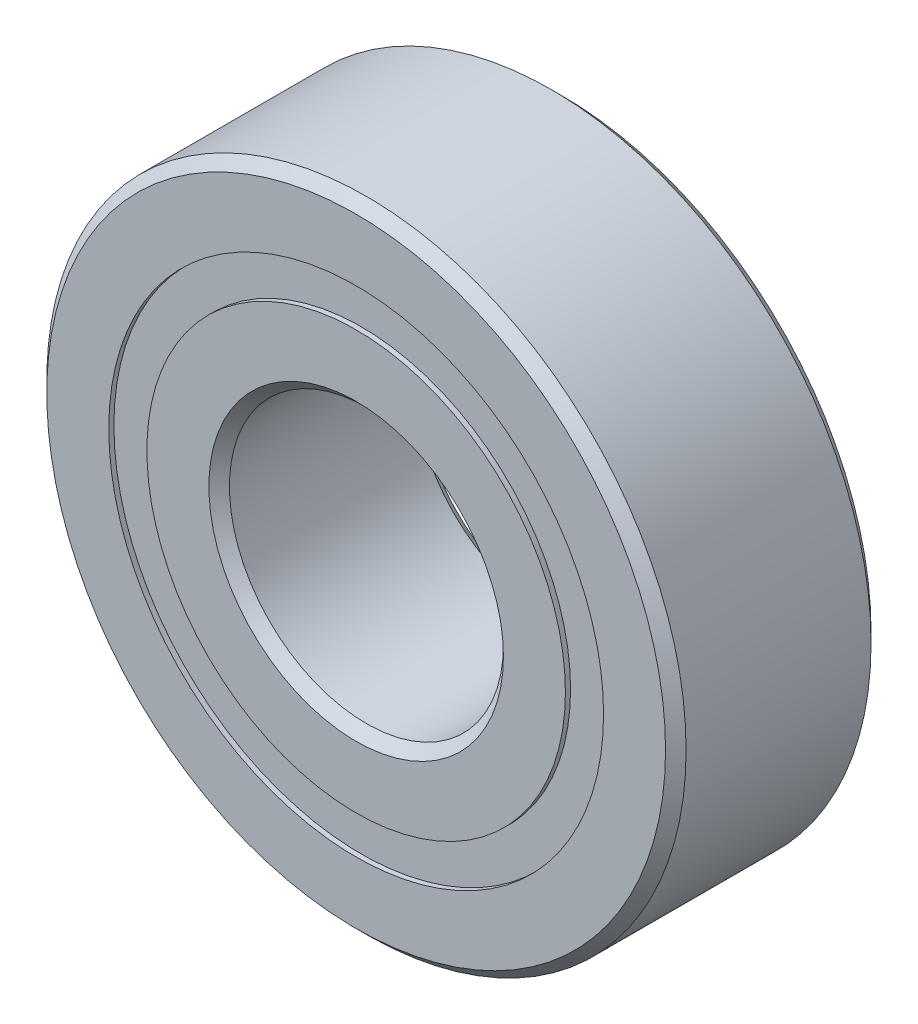
ISO-10303-21;
HEADER;
FILE_DESCRIPTION(('STEP AP214'),'2;1');
FILE_NAME('part.step','',(''),(''),'','','');
FILE_SCHEMA(('AUTOMOTIVE_DESIGN { 1 0 10303 214 1 1 1 1 }'));
ENDSEC;
DATA;
#1=APPLICATION_CONTEXT('core data for automotive mechanical design processes');
#2=APPLICATION_PROTOCOL_DEFINITION('international standard','automotive_design',2000,#1);
#3=PRODUCT_CONTEXT('',#1,'mechanical');
#4=PRODUCT('Part','Part','',(#3));
#5=PRODUCT_RELATED_PRODUCT_CATEGORY('part','',(#4));
#6=PRODUCT_DEFINITION_FORMATION('','',#4);
#7=PRODUCT_DEFINITION_CONTEXT('part definition',#1,'design');
#8=PRODUCT_DEFINITION('design','',#6,#7);
#9=PRODUCT_DEFINITION_SHAPE('','',#8);
#10=(LENGTH_UNIT() NAMED_UNIT(*) SI_UNIT(.MILLI.,.METRE.));
#11=(NAMED_UNIT(*) PLANE_ANGLE_UNIT() SI_UNIT($,.RADIAN.));
#12=(NAMED_UNIT(*) SI_UNIT($,.STERADIAN.) SOLID_ANGLE_UNIT());
#13=UNCERTAINTY_MEASURE_WITH_UNIT(LENGTH_MEASURE(1.E-05),#10,'distance_accuracy_value','');
#14=(GEOMETRIC_REPRESENTATION_CONTEXT(3) GLOBAL_UNCERTAINTY_ASSIGNED_CONTEXT((#13)) GLOBAL_UNIT_ASSIGNED_CONTEXT((#10,
#11,#12)) REPRESENTATION_CONTEXT('',''));
#15=CARTESIAN_POINT('',(0.,0.,0.));
#16=DIRECTION('',(0.,0.,1.));
#17=DIRECTION('',(1.,0.,0.));
#18=AXIS2_PLACEMENT_3D('',#15,#16,#17);
#19=CARTESIAN_POINT('',(0.,8.60041208791209,-3.39328125));
#20=DIRECTION('',(0.,0.,1.));
#21=DIRECTION('',(1.,0.,0.));
#22=AXIS2_PLACEMENT_3D('',#19,#20,#21);
#23=PLANE('',#22);
#24=CARTESIAN_POINT('',(0.,0.,-3.39328125));
#25=DIRECTION('',(0.,0.,1.));
#26=DIRECTION('',(1.,0.,0.));
#27=AXIS2_PLACEMENT_3D('',#24,#25,#26);
#28=CIRCLE('',#27,8.60041208791209);
#29=CARTESIAN_POINT('',(8.60041208791209,0.,-3.39328125));
#30=VERTEX_POINT('',#29);
#31=EDGE_CURVE('E57',#30,#30,#28,.T.);
#32=ORIENTED_EDGE('',*,*,#31,.F.);
#33=EDGE_LOOP('',(#32));
#34=FACE_BOUND('',#33,.T.);
#35=CARTESIAN_POINT('',(0.,0.,-3.39328125));
#36=DIRECTION('',(0.,0.,1.));
#37=DIRECTION('',(1.,0.,0.));
#38=AXIS2_PLACEMENT_3D('',#35,#36,#37);
#39=CIRCLE('',#38,7.27458791208791);
#40=CARTESIAN_POINT('',(7.27458791208791,0.,-3.39328125));
#41=VERTEX_POINT('',#40);
#42=EDGE_CURVE('E11',#41,#41,#39,.T.);
#43=ORIENTED_EDGE('',*,*,#42,.T.);
#44=EDGE_LOOP('',(#43));
#45=FACE_BOUND('',#44,.T.);
#46=ADVANCED_FACE('F43',(#34,#45),#23,.F.);
#47=CARTESIAN_POINT('',(0.,0.,3.571875));
#48=DIRECTION('',(0.,0.,1.));
#49=DIRECTION('',(1.,0.,0.));
#50=AXIS2_PLACEMENT_3D('',#47,#48,#49);
#51=CYLINDRICAL_SURFACE('',#50,7.27458791208791);
#52=ORIENTED_EDGE('',*,*,#42,.F.);
#53=EDGE_LOOP('',(#52));
#54=FACE_BOUND('',#53,.T.);
#55=CARTESIAN_POINT('',(0.,0.,-1.72035132641561));
#56=DIRECTION('',(0.,0.,1.));
#57=DIRECTION('',(1.,0.,0.));
#58=AXIS2_PLACEMENT_3D('',#55,#56,#57);
#59=CIRCLE('',#58,7.27458791208791);
#60=CARTESIAN_POINT('',(7.27458791208791,0.,-1.72035132641561));
#61=VERTEX_POINT('',#60);
#62=EDGE_CURVE('E49',#61,#61,#59,.T.);
#63=ORIENTED_EDGE('',*,*,#62,.T.);
#64=EDGE_LOOP('',(#63));
#65=FACE_BOUND('',#64,.T.);
#66=ADVANCED_FACE('F66',(#54,#65),#51,.F.);
#67=CARTESIAN_POINT('',(0.,8.60041208791209,-1.72035132641561));
#68=DIRECTION('',(0.,0.,-1.));
#69=DIRECTION('',(-1.,0.,0.));
#70=AXIS2_PLACEMENT_3D('',#67,#68,#69);
#71=PLANE('',#70);
#72=ORIENTED_EDGE('',*,*,#62,.F.);
#73=EDGE_LOOP('',(#72));
#74=FACE_BOUND('',#73,.T.);
#75=CARTESIAN_POINT('',(0.,0.,-1.72035132641561));
#76=DIRECTION('',(0.,0.,1.));
#77=DIRECTION('',(1.,0.,0.));
#78=AXIS2_PLACEMENT_3D('',#75,#76,#77);
#79=CIRCLE('',#78,8.60041208791209);
#80=CARTESIAN_POINT('',(8.60041208791209,0.,-1.72035132641561));
#81=VERTEX_POINT('',#80);
#82=EDGE_CURVE('E53',#81,#81,#79,.T.);
#83=ORIENTED_EDGE('',*,*,#82,.T.);
#84=EDGE_LOOP('',(#83));
#85=FACE_BOUND('',#84,.T.);
#86=ADVANCED_FACE('F70',(#74,#85),#71,.F.);
#87=CARTESIAN_POINT('',(0.,0.,3.571875));
#88=DIRECTION('',(0.,0.,1.));
#89=DIRECTION('',(1.,0.,0.));
#90=AXIS2_PLACEMENT_3D('',#87,#88,#89);
#91=CYLINDRICAL_SURFACE('',#90,8.60041208791209);
#92=ORIENTED_EDGE('',*,*,#82,.F.);
#93=EDGE_LOOP('',(#92));
#94=FACE_BOUND('',#93,.T.);
#95=ORIENTED_EDGE('',*,*,#31,.T.);
#96=EDGE_LOOP('',(#95));
#97=FACE_BOUND('',#96,.T.);
#98=ADVANCED_FACE('F63',(#94,#97),#91,.T.);
#99=CLOSED_SHELL('',(#46,#66,#86,#98));
#100=MANIFOLD_SOLID_BREP('B2',#99);
#101=CARTESIAN_POINT('',(0.,8.60041208791209,3.39328125));
#102=DIRECTION('',(0.,0.,-1.));
#103=DIRECTION('',(-1.,0.,0.));
#104=AXIS2_PLACEMENT_3D('',#101,#102,#103);
#105=PLANE('',#104);
#106=CARTESIAN_POINT('',(0.,0.,3.39328125));
#107=DIRECTION('',(0.,0.,1.));
#108=DIRECTION('',(1.,0.,0.));
#109=AXIS2_PLACEMENT_3D('',#106,#107,#108);
#110=CIRCLE('',#109,7.27458791208791);
#111=CARTESIAN_POINT('',(7.27458791208791,0.,3.39328125));
#112=VERTEX_POINT('',#111);
#113=EDGE_CURVE('E42',#112,#112,#110,.T.);
#114=ORIENTED_EDGE('',*,*,#113,.F.);
#115=EDGE_LOOP('',(#114));
#116=FACE_BOUND('',#115,.T.);
#117=CARTESIAN_POINT('',(0.,0.,3.39328125));
#118=DIRECTION('',(0.,0.,1.));
#119=DIRECTION('',(1.,0.,0.));
#120=AXIS2_PLACEMENT_3D('',#117,#118,#119);
#121=CIRCLE('',#120,8.60041208791209);
#122=CARTESIAN_POINT('',(8.60041208791209,0.,3.39328125));
#123=VERTEX_POINT('',#122);
#124=EDGE_CURVE('E124',#123,#123,#121,.T.);
#125=ORIENTED_EDGE('',*,*,#124,.T.);
#126=EDGE_LOOP('',(#125));
#127=FACE_BOUND('',#126,.T.);
#128=ADVANCED_FACE('F110',(#116,#127),#105,.F.);
#129=CARTESIAN_POINT('',(0.,0.,3.571875));
#130=DIRECTION('',(0.,0.,1.));
#131=DIRECTION('',(1.,0.,0.));
#132=AXIS2_PLACEMENT_3D('',#129,#130,#131);
#133=CYLINDRICAL_SURFACE('',#132,7.27458791208791);
#134=CARTESIAN_POINT('',(0.,0.,1.72035132641561));
#135=DIRECTION('',(0.,0.,1.));
#136=DIRECTION('',(1.,0.,0.));
#137=AXIS2_PLACEMENT_3D('',#134,#135,#136);
#138=CIRCLE('',#137,7.27458791208791);
#139=CARTESIAN_POINT('',(7.27458791208791,0.,1.72035132641561));
#140=VERTEX_POINT('',#139);
#141=EDGE_CURVE('E116',#140,#140,#138,.T.);
#142=ORIENTED_EDGE('',*,*,#141,.F.);
#143=EDGE_LOOP('',(#142));
#144=FACE_BOUND('',#143,.T.);
#145=ORIENTED_EDGE('',*,*,#113,.T.);
#146=EDGE_LOOP('',(#145));
#147=FACE_BOUND('',#146,.T.);
#148=ADVANCED_FACE('F139',(#144,#147),#133,.F.);
#149=CARTESIAN_POINT('',(0.,8.60041208791209,1.72035132641561));
#150=DIRECTION('',(0.,0.,1.));
#151=DIRECTION('',(1.,0.,0.));
#152=AXIS2_PLACEMENT_3D('',#149,#150,#151);
#153=PLANE('',#152);
#154=CARTESIAN_POINT('',(0.,0.,1.72035132641561));
#155=DIRECTION('',(0.,0.,1.));
#156=DIRECTION('',(1.,0.,0.));
#157=AXIS2_PLACEMENT_3D('',#154,#155,#156);
#158=CIRCLE('',#157,8.60041208791209);
#159=CARTESIAN_POINT('',(8.60041208791209,0.,1.72035132641561));
#160=VERTEX_POINT('',#159);
#161=EDGE_CURVE('E120',#160,#160,#158,.T.);
#162=ORIENTED_EDGE('',*,*,#161,.F.);
#163=EDGE_LOOP('',(#162));
#164=FACE_BOUND('',#163,.T.);
#165=ORIENTED_EDGE('',*,*,#141,.T.);
#166=EDGE_LOOP('',(#165));
#167=FACE_BOUND('',#166,.T.);
#168=ADVANCED_FACE('F134',(#164,#167),#153,.F.);
#169=CARTESIAN_POINT('',(0.,0.,3.571875));
#170=DIRECTION('',(0.,0.,1.));
#171=DIRECTION('',(1.,0.,0.));
#172=AXIS2_PLACEMENT_3D('',#169,#170,#171);
#173=CYLINDRICAL_SURFACE('',#172,8.60041208791209);
#174=ORIENTED_EDGE('',*,*,#124,.F.);
#175=EDGE_LOOP('',(#174));
#176=FACE_BOUND('',#175,.T.);
#177=ORIENTED_EDGE('',*,*,#161,.T.);
#178=EDGE_LOOP('',(#177));
#179=FACE_BOUND('',#178,.T.);
#180=ADVANCED_FACE('F131',(#176,#179),#173,.T.);
#181=CLOSED_SHELL('',(#128,#148,#168,#180));
#182=MANIFOLD_SOLID_BREP('B6',#181);
#183=CARTESIAN_POINT('',(-4.66554544007142,6.42157239285121,0.));
#184=DIRECTION('',(0.,0.,1.));
#185=DIRECTION('',(-0.587785252292462,0.809016994374955,0.));
#186=AXIS2_PLACEMENT_3D('',#183,#184,#185);
#187=SPHERICAL_SURFACE('',#186,1.72035132641561);
#188=CARTESIAN_POINT('',(-4.66554544007142,6.42157239285121,1.72035132641561));
#189=VERTEX_POINT('',#188);
#190=VERTEX_LOOP('',#189);
#191=FACE_BOUND('',#190,.T.);
#192=ADVANCED_FACE('F177',(#191),#187,.T.);
#193=CLOSED_SHELL('',(#192));
#194=MANIFOLD_SOLID_BREP('B37',#193);
#195=CARTESIAN_POINT('',(-7.54901109809275,2.45282239285123,0.));
#196=DIRECTION('',(0.,0.,1.));
#197=DIRECTION('',(-0.95105651629515,0.309016994374958,0.));
#198=AXIS2_PLACEMENT_3D('',#195,#196,#197);
#199=SPHERICAL_SURFACE('',#198,1.72035132641561);
#200=CARTESIAN_POINT('',(-7.54901109809275,2.45282239285123,1.72035132641561));
#201=VERTEX_POINT('',#200);
#202=VERTEX_LOOP('',#201);
#203=FACE_BOUND('',#202,.T.);
#204=ADVANCED_FACE('F197',(#203),#199,.T.);
#205=CLOSED_SHELL('',(#204));
#206=MANIFOLD_SOLID_BREP('B106',#205);
#207=CARTESIAN_POINT('',(-7.54901109809281,-2.45282239285107,0.));
#208=DIRECTION('',(0.,0.,1.));
#209=DIRECTION('',(-0.951056516295157,-0.309016994374938,0.));
#210=AXIS2_PLACEMENT_3D('',#207,#208,#209);
#211=SPHERICAL_SURFACE('',#210,1.72035132641561);
#212=CARTESIAN_POINT('',(-7.54901109809281,-2.45282239285107,1.72035132641561));
#213=VERTEX_POINT('',#212);
#214=VERTEX_LOOP('',#213);
#215=FACE_BOUND('',#214,.T.);
#216=ADVANCED_FACE('F217',(#215),#211,.T.);
#217=CLOSED_SHELL('',(#216));
#218=MANIFOLD_SOLID_BREP('B173',#217);
#219=CARTESIAN_POINT('',(-4.66554544007156,-6.42157239285111,0.));
#220=DIRECTION('',(0.,0.,1.));
#221=DIRECTION('',(-0.58778525229248,-0.809016994374942,0.));
#222=AXIS2_PLACEMENT_3D('',#219,#220,#221);
#223=SPHERICAL_SURFACE('',#222,1.72035132641561);
#224=CARTESIAN_POINT('',(-4.66554544007156,-6.42157239285111,1.72035132641561));
#225=VERTEX_POINT('',#224);
#226=VERTEX_LOOP('',#225);
#227=FACE_BOUND('',#226,.T.);
#228=ADVANCED_FACE('F237',(#227),#223,.T.);
#229=CLOSED_SHELL('',(#228));
#230=MANIFOLD_SOLID_BREP('B193',#229);
#231=CARTESIAN_POINT('',(0.,-7.9375,0.));
#232=DIRECTION('',(0.,0.,1.));
#233=DIRECTION('',(0.,-1.,0.));
#234=AXIS2_PLACEMENT_3D('',#231,#232,#233);
#235=SPHERICAL_SURFACE('',#234,1.72035132641561);
#236=CARTESIAN_POINT('',(0.,-7.9375,1.72035132641561));
#237=VERTEX_POINT('',#236);
#238=VERTEX_LOOP('',#237);
#239=FACE_BOUND('',#238,.T.);
#240=ADVANCED_FACE('F257',(#239),#235,.T.);
#241=CLOSED_SHELL('',(#240));
#242=MANIFOLD_SOLID_BREP('B213',#241);
#243=CARTESIAN_POINT('',(4.66554544007147,-6.42157239285117,0.));
#244=DIRECTION('',(0.,0.,1.));
#245=DIRECTION('',(0.587785252292469,-0.809016994374951,0.));
#246=AXIS2_PLACEMENT_3D('',#243,#244,#245);
#247=SPHERICAL_SURFACE('',#246,1.72035132641561);
#248=CARTESIAN_POINT('',(4.66554544007147,-6.42157239285117,1.72035132641561));
#249=VERTEX_POINT('',#248);
#250=VERTEX_LOOP('',#249);
#251=FACE_BOUND('',#250,.T.);
#252=ADVANCED_FACE('F277',(#251),#247,.T.);
#253=CLOSED_SHELL('',(#252));
#254=MANIFOLD_SOLID_BREP('B233',#253);
#255=CARTESIAN_POINT('',(7.54901109809277,-2.45282239285118,0.));
#256=DIRECTION('',(0.,0.,1.));
#257=DIRECTION('',(0.951056516295152,-0.309016994374952,0.));
#258=AXIS2_PLACEMENT_3D('',#255,#256,#257);
#259=SPHERICAL_SURFACE('',#258,1.72035132641561);
#260=CARTESIAN_POINT('',(7.54901109809277,-2.45282239285118,1.72035132641561));
#261=VERTEX_POINT('',#260);
#262=VERTEX_LOOP('',#261);
#263=FACE_BOUND('',#262,.T.);
#264=ADVANCED_FACE('F297',(#263),#259,.T.);
#265=CLOSED_SHELL('',(#264));
#266=MANIFOLD_SOLID_BREP('B253',#265);
#267=CARTESIAN_POINT('',(7.54901109809279,2.45282239285112,0.));
#268=DIRECTION('',(0.,0.,1.));
#269=DIRECTION('',(0.951056516295155,0.309016994374945,0.));
#270=AXIS2_PLACEMENT_3D('',#267,#268,#269);
#271=SPHERICAL_SURFACE('',#270,1.72035132641561);
#272=CARTESIAN_POINT('',(7.54901109809279,2.45282239285112,1.72035132641561));
#273=VERTEX_POINT('',#272);
#274=VERTEX_LOOP('',#273);
#275=FACE_BOUND('',#274,.T.);
#276=ADVANCED_FACE('F317',(#275),#271,.T.);
#277=CLOSED_SHELL('',(#276));
#278=MANIFOLD_SOLID_BREP('B273',#277);
#279=CARTESIAN_POINT('',(4.66554544007152,6.42157239285114,0.));
#280=DIRECTION('',(0.,0.,1.));
#281=DIRECTION('',(0.587785252292474,0.809016994374947,0.));
#282=AXIS2_PLACEMENT_3D('',#279,#280,#281);
#283=SPHERICAL_SURFACE('',#282,1.72035132641561);
#284=CARTESIAN_POINT('',(4.66554544007152,6.42157239285114,1.72035132641561));
#285=VERTEX_POINT('',#284);
#286=VERTEX_LOOP('',#285);
#287=FACE_BOUND('',#286,.T.);
#288=ADVANCED_FACE('F337',(#287),#283,.T.);
#289=CLOSED_SHELL('',(#288));
#290=MANIFOLD_SOLID_BREP('B293',#289);
#291=CARTESIAN_POINT('',(0.,7.9375,0.));
#292=DIRECTION('',(0.,0.,1.));
#293=DIRECTION('',(0.,1.,0.));
#294=AXIS2_PLACEMENT_3D('',#291,#292,#293);
#295=SPHERICAL_SURFACE('',#294,1.72035132641561);
#296=CARTESIAN_POINT('',(0.,7.9375,1.72035132641561));
#297=VERTEX_POINT('',#296);
#298=VERTEX_LOOP('',#297);
#299=FACE_BOUND('',#298,.T.);
#300=ADVANCED_FACE('F359',(#299),#295,.T.);
#301=CLOSED_SHELL('',(#300));
#302=MANIFOLD_SOLID_BREP('B313',#301);
#303=CARTESIAN_POINT('',(0.,7.27458791208791,3.571875));
#304=DIRECTION('',(0.,0.,-1.));
#305=DIRECTION('',(-1.,0.,0.));
#306=AXIS2_PLACEMENT_3D('',#303,#304,#305);
#307=PLANE('',#306);
#308=CARTESIAN_POINT('',(0.,0.,3.571875));
#309=DIRECTION('',(0.,0.,1.));
#310=DIRECTION('',(1.,0.,0.));
#311=AXIS2_PLACEMENT_3D('',#308,#309,#310);
#312=CIRCLE('',#311,5.1196875);
#313=CARTESIAN_POINT('',(5.1196875,0.,3.571875));
#314=VERTEX_POINT('',#313);
#315=EDGE_CURVE('E406',#314,#314,#312,.T.);
#316=ORIENTED_EDGE('',*,*,#315,.F.);
#317=EDGE_LOOP('',(#316));
#318=FACE_BOUND('',#317,.T.);
#319=CARTESIAN_POINT('',(0.,0.,3.571875));
#320=DIRECTION('',(0.,0.,1.));
#321=DIRECTION('',(1.,0.,0.));
#322=AXIS2_PLACEMENT_3D('',#319,#320,#321);
#323=CIRCLE('',#322,7.27458791208791);
#324=CARTESIAN_POINT('',(7.27458791208791,0.,3.571875));
#325=VERTEX_POINT('',#324);
#326=EDGE_CURVE('E358',#325,#325,#323,.T.);
#327=ORIENTED_EDGE('',*,*,#326,.T.);
#328=EDGE_LOOP('',(#327));
#329=FACE_BOUND('',#328,.T.);
#330=ADVANCED_FACE('F378',(#318,#329),#307,.F.);
#331=CARTESIAN_POINT('',(0.,0.,3.571875));
#332=DIRECTION('',(0.,0.,1.));
#333=DIRECTION('',(1.,0.,0.));
#334=AXIS2_PLACEMENT_3D('',#331,#332,#333);
#335=CYLINDRICAL_SURFACE('',#334,7.27458791208791);
#336=ORIENTED_EDGE('',*,*,#326,.F.);
#337=EDGE_LOOP('',(#336));
#338=FACE_BOUND('',#337,.T.);
#339=CARTESIAN_POINT('',(0.,0.,1.5875));
#340=DIRECTION('',(0.,0.,1.));
#341=DIRECTION('',(1.,0.,0.));
#342=AXIS2_PLACEMENT_3D('',#339,#340,#341);
#343=CIRCLE('',#342,7.27458791208791);
#344=CARTESIAN_POINT('',(7.27458791208791,0.,1.5875));
#345=VERTEX_POINT('',#344);
#346=EDGE_CURVE('E384',#345,#345,#343,.T.);
#347=ORIENTED_EDGE('',*,*,#346,.T.);
#348=EDGE_LOOP('',(#347));
#349=FACE_BOUND('',#348,.T.);
#350=ADVANCED_FACE('F413',(#338,#349),#335,.T.);
#351=CARTESIAN_POINT('',(0.,0.,0.));
#352=DIRECTION('',(0.,0.,1.));
#353=DIRECTION('',(1.,0.,0.));
#354=AXIS2_PLACEMENT_3D('',#351,#352,#353);
#355=TOROIDAL_SURFACE('',#354,7.93749999999999,1.72035132641561);
#356=ORIENTED_EDGE('',*,*,#346,.F.);
#357=EDGE_LOOP('',(#356));
#358=FACE_BOUND('',#357,.T.);
#359=CARTESIAN_POINT('',(0.,0.,-1.5875));
#360=DIRECTION('',(0.,0.,1.));
#361=DIRECTION('',(1.,0.,0.));
#362=AXIS2_PLACEMENT_3D('',#359,#360,#361);
#363=CIRCLE('',#362,7.27458791208791);
#364=CARTESIAN_POINT('',(7.27458791208791,0.,-1.5875));
#365=VERTEX_POINT('',#364);
#366=EDGE_CURVE('E388',#365,#365,#363,.T.);
#367=ORIENTED_EDGE('',*,*,#366,.T.);
#368=EDGE_LOOP('',(#367));
#369=FACE_BOUND('',#368,.T.);
#370=ADVANCED_FACE('F417',(#358,#369),#355,.F.);
#371=CARTESIAN_POINT('',(0.,0.,3.571875));
#372=DIRECTION('',(0.,0.,1.));
#373=DIRECTION('',(1.,0.,0.));
#374=AXIS2_PLACEMENT_3D('',#371,#372,#373);
#375=CYLINDRICAL_SURFACE('',#374,7.27458791208791);
#376=ORIENTED_EDGE('',*,*,#366,.F.);
#377=EDGE_LOOP('',(#376));
#378=FACE_BOUND('',#377,.T.);
#379=CARTESIAN_POINT('',(0.,0.,-3.571875));
#380=DIRECTION('',(0.,0.,1.));
#381=DIRECTION('',(1.,0.,0.));
#382=AXIS2_PLACEMENT_3D('',#379,#380,#381);
#383=CIRCLE('',#382,7.27458791208791);
#384=CARTESIAN_POINT('',(7.27458791208791,0.,-3.571875));
#385=VERTEX_POINT('',#384);
#386=EDGE_CURVE('E392',#385,#385,#383,.T.);
#387=ORIENTED_EDGE('',*,*,#386,.T.);
#388=EDGE_LOOP('',(#387));
#389=FACE_BOUND('',#388,.T.);
#390=ADVANCED_FACE('F422',(#378,#389),#375,.T.);
#391=CARTESIAN_POINT('',(0.,5.1196875,-3.571875));
#392=DIRECTION('',(0.,0.,1.));
#393=DIRECTION('',(1.,0.,0.));
#394=AXIS2_PLACEMENT_3D('',#391,#392,#393);
#395=PLANE('',#394);
#396=ORIENTED_EDGE('',*,*,#386,.F.);
#397=EDGE_LOOP('',(#396));
#398=FACE_BOUND('',#397,.T.);
#399=CARTESIAN_POINT('',(0.,0.,-3.571875));
#400=DIRECTION('',(0.,0.,1.));
#401=DIRECTION('',(1.,0.,0.));
#402=AXIS2_PLACEMENT_3D('',#399,#400,#401);
#403=CIRCLE('',#402,5.1196875);
#404=CARTESIAN_POINT('',(5.1196875,0.,-3.571875));
#405=VERTEX_POINT('',#404);
#406=EDGE_CURVE('E397',#405,#405,#403,.T.);
#407=ORIENTED_EDGE('',*,*,#406,.T.);
#408=EDGE_LOOP('',(#407));
#409=FACE_BOUND('',#408,.T.);
#410=ADVANCED_FACE('F428',(#398,#409),#395,.F.);
#411=CARTESIAN_POINT('',(0.,0.,-3.2146875));
#412=DIRECTION('',(0.,0.,-1.));
#413=DIRECTION('',(-1.,0.,0.));
#414=AXIS2_PLACEMENT_3D('',#411,#412,#413);
#415=CONICAL_SURFACE('',#414,4.7625,0.785398163397442);
#416=ORIENTED_EDGE('',*,*,#406,.F.);
#417=EDGE_LOOP('',(#416));
#418=FACE_BOUND('',#417,.T.);
#419=CARTESIAN_POINT('',(0.,0.,-3.2146875));
#420=DIRECTION('',(0.,0.,1.));
#421=DIRECTION('',(1.,0.,0.));
#422=AXIS2_PLACEMENT_3D('',#419,#420,#421);
#423=CIRCLE('',#422,4.7625);
#424=CARTESIAN_POINT('',(4.7625,0.,-3.2146875));
#425=VERTEX_POINT('',#424);
#426=EDGE_CURVE('E400',#425,#425,#423,.T.);
#427=ORIENTED_EDGE('',*,*,#426,.T.);
#428=EDGE_LOOP('',(#427));
#429=FACE_BOUND('',#428,.T.);
#430=ADVANCED_FACE('F432',(#418,#429),#415,.F.);
#431=CARTESIAN_POINT('',(0.,0.,3.571875));
#432=DIRECTION('',(0.,0.,1.));
#433=DIRECTION('',(1.,0.,0.));
#434=AXIS2_PLACEMENT_3D('',#431,#432,#433);
#435=CYLINDRICAL_SURFACE('',#434,4.7625);
#436=ORIENTED_EDGE('',*,*,#426,.F.);
#437=EDGE_LOOP('',(#436));
#438=FACE_BOUND('',#437,.T.);
#439=CARTESIAN_POINT('',(0.,0.,3.2146875));
#440=DIRECTION('',(0.,0.,1.));
#441=DIRECTION('',(1.,0.,0.));
#442=AXIS2_PLACEMENT_3D('',#439,#440,#441);
#443=CIRCLE('',#442,4.7625);
#444=CARTESIAN_POINT('',(4.7625,0.,3.2146875));
#445=VERTEX_POINT('',#444);
#446=EDGE_CURVE('E403',#445,#445,#443,.T.);
#447=ORIENTED_EDGE('',*,*,#446,.T.);
#448=EDGE_LOOP('',(#447));
#449=FACE_BOUND('',#448,.T.);
#450=ADVANCED_FACE('F436',(#438,#449),#435,.F.);
#451=CARTESIAN_POINT('',(0.,0.,3.571875));
#452=DIRECTION('',(0.,0.,1.));
#453=DIRECTION('',(1.,0.,0.));
#454=AXIS2_PLACEMENT_3D('',#451,#452,#453);
#455=CONICAL_SURFACE('',#454,5.1196875,0.785398163397453);
#456=ORIENTED_EDGE('',*,*,#446,.F.);
#457=EDGE_LOOP('',(#456));
#458=FACE_BOUND('',#457,.T.);
#459=ORIENTED_EDGE('',*,*,#315,.T.);
#460=EDGE_LOOP('',(#459));
#461=FACE_BOUND('',#460,.T.);
#462=ADVANCED_FACE('F410',(#458,#461),#455,.F.);
#463=CLOSED_SHELL('',(#330,#350,#370,#390,#410,#430,#450,#462));
#464=MANIFOLD_SOLID_BREP('B333',#463);
#465=CARTESIAN_POINT('',(0.,0.,3.2146875));
#466=DIRECTION('',(0.,0.,-1.));
#467=DIRECTION('',(-1.,0.,0.));
#468=AXIS2_PLACEMENT_3D('',#465,#466,#467);
#469=CONICAL_SURFACE('',#468,11.1125,0.785398163397446);
#470=CARTESIAN_POINT('',(0.,0.,3.571875));
#471=DIRECTION('',(0.,0.,1.));
#472=DIRECTION('',(1.,0.,0.));
#473=AXIS2_PLACEMENT_3D('',#470,#471,#472);
#474=CIRCLE('',#473,10.7553125);
#475=CARTESIAN_POINT('',(10.7553125,0.,3.571875));
#476=VERTEX_POINT('',#475);
#477=EDGE_CURVE('E527',#476,#476,#474,.T.);
#478=ORIENTED_EDGE('',*,*,#477,.F.);
#479=EDGE_LOOP('',(#478));
#480=FACE_BOUND('',#479,.T.);
#481=CARTESIAN_POINT('',(0.,0.,3.2146875));
#482=DIRECTION('',(0.,0.,1.));
#483=DIRECTION('',(1.,0.,0.));
#484=AXIS2_PLACEMENT_3D('',#481,#482,#483);
#485=CIRCLE('',#484,11.1125);
#486=CARTESIAN_POINT('',(11.1125,0.,3.2146875));
#487=VERTEX_POINT('',#486);
#488=EDGE_CURVE('E377',#487,#487,#485,.T.);
#489=ORIENTED_EDGE('',*,*,#488,.T.);
#490=EDGE_LOOP('',(#489));
#491=FACE_BOUND('',#490,.T.);
#492=ADVANCED_FACE('F499',(#480,#491),#469,.T.);
#493=CARTESIAN_POINT('',(0.,0.,3.571875));
#494=DIRECTION('',(0.,0.,1.));
#495=DIRECTION('',(1.,0.,0.));
#496=AXIS2_PLACEMENT_3D('',#493,#494,#495);
#497=CYLINDRICAL_SURFACE('',#496,11.1125);
#498=ORIENTED_EDGE('',*,*,#488,.F.);
#499=EDGE_LOOP('',(#498));
#500=FACE_BOUND('',#499,.T.);
#501=CARTESIAN_POINT('',(0.,0.,-3.2146875));
#502=DIRECTION('',(0.,0.,1.));
#503=DIRECTION('',(1.,0.,0.));
#504=AXIS2_PLACEMENT_3D('',#501,#502,#503);
#505=CIRCLE('',#504,11.1125);
#506=CARTESIAN_POINT('',(11.1125,0.,-3.2146875));
#507=VERTEX_POINT('',#506);
#508=EDGE_CURVE('E505',#507,#507,#505,.T.);
#509=ORIENTED_EDGE('',*,*,#508,.T.);
#510=EDGE_LOOP('',(#509));
#511=FACE_BOUND('',#510,.T.);
#512=ADVANCED_FACE('F534',(#500,#511),#497,.T.);
#513=CARTESIAN_POINT('',(0.,0.,-3.571875));
#514=DIRECTION('',(0.,0.,1.));
#515=DIRECTION('',(1.,0.,0.));
#516=AXIS2_PLACEMENT_3D('',#513,#514,#515);
#517=CONICAL_SURFACE('',#516,10.7553125,0.785398163397444);
#518=ORIENTED_EDGE('',*,*,#508,.F.);
#519=EDGE_LOOP('',(#518));
#520=FACE_BOUND('',#519,.T.);
#521=CARTESIAN_POINT('',(0.,0.,-3.571875));
#522=DIRECTION('',(0.,0.,1.));
#523=DIRECTION('',(1.,0.,0.));
#524=AXIS2_PLACEMENT_3D('',#521,#522,#523);
#525=CIRCLE('',#524,10.7553125);
#526=CARTESIAN_POINT('',(10.7553125,0.,-3.571875));
#527=VERTEX_POINT('',#526);
#528=EDGE_CURVE('E509',#527,#527,#525,.T.);
#529=ORIENTED_EDGE('',*,*,#528,.T.);
#530=EDGE_LOOP('',(#529));
#531=FACE_BOUND('',#530,.T.);
#532=ADVANCED_FACE('F538',(#520,#531),#517,.T.);
#533=CARTESIAN_POINT('',(0.,10.7553125,-3.571875));
#534=DIRECTION('',(0.,0.,1.));
#535=DIRECTION('',(1.,0.,0.));
#536=AXIS2_PLACEMENT_3D('',#533,#534,#535);
#537=PLANE('',#536);
#538=ORIENTED_EDGE('',*,*,#528,.F.);
#539=EDGE_LOOP('',(#538));
#540=FACE_BOUND('',#539,.T.);
#541=CARTESIAN_POINT('',(0.,0.,-3.571875));
#542=DIRECTION('',(0.,0.,1.));
#543=DIRECTION('',(1.,0.,0.));
#544=AXIS2_PLACEMENT_3D('',#541,#542,#543);
#545=CIRCLE('',#544,8.60041208791209);
#546=CARTESIAN_POINT('',(8.60041208791209,0.,-3.571875));
#547=VERTEX_POINT('',#546);
#548=EDGE_CURVE('E513',#547,#547,#545,.T.);
#549=ORIENTED_EDGE('',*,*,#548,.T.);
#550=EDGE_LOOP('',(#549));
#551=FACE_BOUND('',#550,.T.);
#552=ADVANCED_FACE('F543',(#540,#551),#537,.F.);
#553=CARTESIAN_POINT('',(0.,0.,3.571875));
#554=DIRECTION('',(0.,0.,1.));
#555=DIRECTION('',(1.,0.,0.));
#556=AXIS2_PLACEMENT_3D('',#553,#554,#555);
#557=CYLINDRICAL_SURFACE('',#556,8.60041208791209);
#558=ORIENTED_EDGE('',*,*,#548,.F.);
#559=EDGE_LOOP('',(#558));
#560=FACE_BOUND('',#559,.T.);
#561=CARTESIAN_POINT('',(0.,0.,-1.5875));
#562=DIRECTION('',(0.,0.,1.));
#563=DIRECTION('',(1.,0.,0.));
#564=AXIS2_PLACEMENT_3D('',#561,#562,#563);
#565=CIRCLE('',#564,8.60041208791209);
#566=CARTESIAN_POINT('',(8.60041208791209,0.,-1.5875));
#567=VERTEX_POINT('',#566);
#568=EDGE_CURVE('E518',#567,#567,#565,.T.);
#569=ORIENTED_EDGE('',*,*,#568,.T.);
#570=EDGE_LOOP('',(#569));
#571=FACE_BOUND('',#570,.T.);
#572=ADVANCED_FACE('F549',(#560,#571),#557,.F.);
#573=CARTESIAN_POINT('',(0.,0.,0.));
#574=DIRECTION('',(0.,0.,1.));
#575=DIRECTION('',(1.,0.,0.));
#576=AXIS2_PLACEMENT_3D('',#573,#574,#575);
#577=TOROIDAL_SURFACE('',#576,7.9375,1.72035132641561);
#578=ORIENTED_EDGE('',*,*,#568,.F.);
#579=EDGE_LOOP('',(#578));
#580=FACE_BOUND('',#579,.T.);
#581=CARTESIAN_POINT('',(0.,0.,1.5875));
#582=DIRECTION('',(0.,0.,1.));
#583=DIRECTION('',(1.,0.,0.));
#584=AXIS2_PLACEMENT_3D('',#581,#582,#583);
#585=CIRCLE('',#584,8.60041208791209);
#586=CARTESIAN_POINT('',(8.60041208791209,0.,1.5875));
#587=VERTEX_POINT('',#586);
#588=EDGE_CURVE('E521',#587,#587,#585,.T.);
#589=ORIENTED_EDGE('',*,*,#588,.T.);
#590=EDGE_LOOP('',(#589));
#591=FACE_BOUND('',#590,.T.);
#592=ADVANCED_FACE('F553',(#580,#591),#577,.F.);
#593=CARTESIAN_POINT('',(0.,0.,3.571875));
#594=DIRECTION('',(0.,0.,1.));
#595=DIRECTION('',(1.,0.,0.));
#596=AXIS2_PLACEMENT_3D('',#593,#594,#595);
#597=CYLINDRICAL_SURFACE('',#596,8.60041208791209);
#598=ORIENTED_EDGE('',*,*,#588,.F.);
#599=EDGE_LOOP('',(#598));
#600=FACE_BOUND('',#599,.T.);
#601=CARTESIAN_POINT('',(0.,0.,3.571875));
#602=DIRECTION('',(0.,0.,1.));
#603=DIRECTION('',(1.,0.,0.));
#604=AXIS2_PLACEMENT_3D('',#601,#602,#603);
#605=CIRCLE('',#604,8.60041208791209);
#606=CARTESIAN_POINT('',(8.60041208791209,0.,3.571875));
#607=VERTEX_POINT('',#606);
#608=EDGE_CURVE('E524',#607,#607,#605,.T.);
#609=ORIENTED_EDGE('',*,*,#608,.T.);
#610=EDGE_LOOP('',(#609));
#611=FACE_BOUND('',#610,.T.);
#612=ADVANCED_FACE('F557',(#600,#611),#597,.F.);
#613=CARTESIAN_POINT('',(0.,10.7553125,3.571875));
#614=DIRECTION('',(0.,0.,-1.));
#615=DIRECTION('',(-1.,0.,0.));
#616=AXIS2_PLACEMENT_3D('',#613,#614,#615);
#617=PLANE('',#616);
#618=ORIENTED_EDGE('',*,*,#608,.F.);
#619=EDGE_LOOP('',(#618));
#620=FACE_BOUND('',#619,.T.);
#621=ORIENTED_EDGE('',*,*,#477,.T.);
#622=EDGE_LOOP('',(#621));
#623=FACE_BOUND('',#622,.T.);
#624=ADVANCED_FACE('F531',(#620,#623),#617,.F.);
#625=CLOSED_SHELL('',(#492,#512,#532,#552,#572,#592,#612,#624));
#626=MANIFOLD_SOLID_BREP('B353',#625);
#627=ADVANCED_BREP_SHAPE_REPRESENTATION('',(#18,#100,#182,#194,#206,#218,#230,#242,#254,#266,
#278,#290,#302,#464,#626),#14);
#628=SHAPE_DEFINITION_REPRESENTATION(#9,#627);
ENDSEC;
END-ISO-10303-21;
